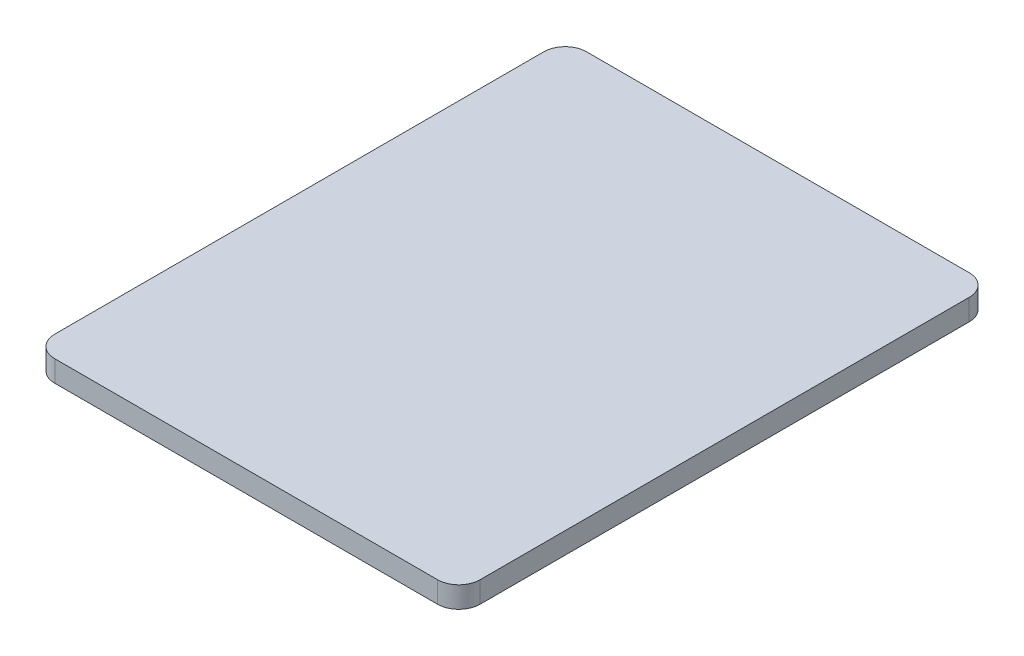
ISO-10303-21;
HEADER;
FILE_DESCRIPTION(('STEP AP214'),'2;1');
FILE_NAME('part.step','',(''),(''),'','','');
FILE_SCHEMA(('AUTOMOTIVE_DESIGN { 1 0 10303 214 1 1 1 1 }'));
ENDSEC;
DATA;
#1=APPLICATION_CONTEXT('core data for automotive mechanical design processes');
#2=APPLICATION_PROTOCOL_DEFINITION('international standard','automotive_design',2000,#1);
#3=PRODUCT_CONTEXT('',#1,'mechanical');
#4=PRODUCT('Part','Part','',(#3));
#5=PRODUCT_RELATED_PRODUCT_CATEGORY('part','',(#4));
#6=PRODUCT_DEFINITION_FORMATION('','',#4);
#7=PRODUCT_DEFINITION_CONTEXT('part definition',#1,'design');
#8=PRODUCT_DEFINITION('design','',#6,#7);
#9=PRODUCT_DEFINITION_SHAPE('','',#8);
#10=(LENGTH_UNIT() NAMED_UNIT(*) SI_UNIT(.MILLI.,.METRE.));
#11=(NAMED_UNIT(*) PLANE_ANGLE_UNIT() SI_UNIT($,.RADIAN.));
#12=(NAMED_UNIT(*) SI_UNIT($,.STERADIAN.) SOLID_ANGLE_UNIT());
#13=UNCERTAINTY_MEASURE_WITH_UNIT(LENGTH_MEASURE(1.E-05),#10,'distance_accuracy_value','');
#14=(GEOMETRIC_REPRESENTATION_CONTEXT(3) GLOBAL_UNCERTAINTY_ASSIGNED_CONTEXT((#13)) GLOBAL_UNIT_ASSIGNED_CONTEXT((#10,
#11,#12)) REPRESENTATION_CONTEXT('',''));
#15=CARTESIAN_POINT('',(0.,0.,0.));
#16=DIRECTION('',(0.,0.,1.));
#17=DIRECTION('',(1.,0.,0.));
#18=AXIS2_PLACEMENT_3D('',#15,#16,#17);
#19=CARTESIAN_POINT('',(100.,10.,125.));
#20=DIRECTION('',(-1.,0.,0.));
#21=DIRECTION('',(0.,0.,1.));
#22=AXIS2_PLACEMENT_3D('',#19,#20,#21);
#23=PLANE('',#22);
#24=DIRECTION('',(0.,0.,-1.));
#25=VECTOR('',#24,1.);
#26=CARTESIAN_POINT('',(100.,0.,125.));
#27=LINE('',#26,#25);
#28=CARTESIAN_POINT('',(100.,0.,115.));
#29=VERTEX_POINT('',#28);
#30=CARTESIAN_POINT('',(100.,0.,-115.));
#31=VERTEX_POINT('',#30);
#32=EDGE_CURVE('E137',#29,#31,#27,.T.);
#33=ORIENTED_EDGE('',*,*,#32,.T.);
#34=DIRECTION('',(0.,-1.,0.));
#35=VECTOR('',#34,1.);
#36=CARTESIAN_POINT('',(100.,10.,-115.));
#37=LINE('',#36,#35);
#38=CARTESIAN_POINT('',(100.,10.,-115.));
#39=VERTEX_POINT('',#38);
#40=EDGE_CURVE('E117',#31,#39,#37,.F.);
#41=ORIENTED_EDGE('',*,*,#40,.T.);
#42=DIRECTION('',(0.,0.,-1.));
#43=VECTOR('',#42,1.);
#44=CARTESIAN_POINT('',(100.,10.,125.));
#45=LINE('',#44,#43);
#46=CARTESIAN_POINT('',(100.,10.,115.));
#47=VERTEX_POINT('',#46);
#48=EDGE_CURVE('E148',#47,#39,#45,.T.);
#49=ORIENTED_EDGE('',*,*,#48,.F.);
#50=DIRECTION('',(0.,-1.,0.));
#51=VECTOR('',#50,1.);
#52=CARTESIAN_POINT('',(100.,10.,115.));
#53=LINE('',#52,#51);
#54=EDGE_CURVE('E123',#47,#29,#53,.T.);
#55=ORIENTED_EDGE('',*,*,#54,.T.);
#56=EDGE_LOOP('',(#33,#41,#49,#55));
#57=FACE_BOUND('',#56,.T.);
#58=ADVANCED_FACE('F43',(#57),#23,.F.);
#59=CARTESIAN_POINT('',(-100.,10.,-125.));
#60=DIRECTION('',(0.,0.,1.));
#61=DIRECTION('',(1.,0.,0.));
#62=AXIS2_PLACEMENT_3D('',#59,#60,#61);
#63=PLANE('',#62);
#64=DIRECTION('',(-1.,0.,0.));
#65=VECTOR('',#64,1.);
#66=CARTESIAN_POINT('',(-100.,0.,-125.));
#67=LINE('',#66,#65);
#68=CARTESIAN_POINT('',(90.,0.,-125.));
#69=VERTEX_POINT('',#68);
#70=CARTESIAN_POINT('',(-90.,0.,-125.));
#71=VERTEX_POINT('',#70);
#72=EDGE_CURVE('E127',#69,#71,#67,.T.);
#73=ORIENTED_EDGE('',*,*,#72,.T.);
#74=DIRECTION('',(0.,-1.,0.));
#75=VECTOR('',#74,1.);
#76=CARTESIAN_POINT('',(-90.,10.,-125.));
#77=LINE('',#76,#75);
#78=CARTESIAN_POINT('',(-90.,10.,-125.));
#79=VERTEX_POINT('',#78);
#80=EDGE_CURVE('E67',#71,#79,#77,.F.);
#81=ORIENTED_EDGE('',*,*,#80,.T.);
#82=DIRECTION('',(-1.,0.,0.));
#83=VECTOR('',#82,1.);
#84=CARTESIAN_POINT('',(-100.,10.,-125.));
#85=LINE('',#84,#83);
#86=CARTESIAN_POINT('',(90.,10.,-125.));
#87=VERTEX_POINT('',#86);
#88=EDGE_CURVE('E128',#87,#79,#85,.T.);
#89=ORIENTED_EDGE('',*,*,#88,.F.);
#90=DIRECTION('',(0.,-1.,0.));
#91=VECTOR('',#90,1.);
#92=CARTESIAN_POINT('',(90.,10.,-125.));
#93=LINE('',#92,#91);
#94=EDGE_CURVE('E116',#87,#69,#93,.T.);
#95=ORIENTED_EDGE('',*,*,#94,.T.);
#96=EDGE_LOOP('',(#73,#81,#89,#95));
#97=FACE_BOUND('',#96,.T.);
#98=ADVANCED_FACE('F126',(#97),#63,.F.);
#99=CARTESIAN_POINT('',(-100.,10.,125.));
#100=DIRECTION('',(1.,0.,0.));
#101=DIRECTION('',(0.,0.,-1.));
#102=AXIS2_PLACEMENT_3D('',#99,#100,#101);
#103=PLANE('',#102);
#104=DIRECTION('',(0.,0.,1.));
#105=VECTOR('',#104,1.);
#106=CARTESIAN_POINT('',(-100.,10.,125.));
#107=LINE('',#106,#105);
#108=CARTESIAN_POINT('',(-100.,10.,-115.));
#109=VERTEX_POINT('',#108);
#110=CARTESIAN_POINT('',(-100.,10.,115.));
#111=VERTEX_POINT('',#110);
#112=EDGE_CURVE('E187',#109,#111,#107,.T.);
#113=ORIENTED_EDGE('',*,*,#112,.F.);
#114=DIRECTION('',(0.,-1.,0.));
#115=VECTOR('',#114,1.);
#116=CARTESIAN_POINT('',(-100.,10.,-115.));
#117=LINE('',#116,#115);
#118=CARTESIAN_POINT('',(-100.,0.,-115.));
#119=VERTEX_POINT('',#118);
#120=EDGE_CURVE('E171',#109,#119,#117,.T.);
#121=ORIENTED_EDGE('',*,*,#120,.T.);
#122=DIRECTION('',(0.,0.,1.));
#123=VECTOR('',#122,1.);
#124=CARTESIAN_POINT('',(-100.,0.,125.));
#125=LINE('',#124,#123);
#126=CARTESIAN_POINT('',(-100.,0.,115.));
#127=VERTEX_POINT('',#126);
#128=EDGE_CURVE('E136',#119,#127,#125,.T.);
#129=ORIENTED_EDGE('',*,*,#128,.T.);
#130=DIRECTION('',(0.,-1.,0.));
#131=VECTOR('',#130,1.);
#132=CARTESIAN_POINT('',(-100.,10.,115.));
#133=LINE('',#132,#131);
#134=EDGE_CURVE('E168',#127,#111,#133,.F.);
#135=ORIENTED_EDGE('',*,*,#134,.T.);
#136=EDGE_LOOP('',(#113,#121,#129,#135));
#137=FACE_BOUND('',#136,.T.);
#138=ADVANCED_FACE('F191',(#137),#103,.F.);
#139=CARTESIAN_POINT('',(-100.,10.,125.));
#140=DIRECTION('',(0.,0.,-1.));
#141=DIRECTION('',(-1.,0.,0.));
#142=AXIS2_PLACEMENT_3D('',#139,#140,#141);
#143=PLANE('',#142);
#144=DIRECTION('',(1.,0.,0.));
#145=VECTOR('',#144,1.);
#146=CARTESIAN_POINT('',(-100.,10.,125.));
#147=LINE('',#146,#145);
#148=CARTESIAN_POINT('',(-90.,10.,125.));
#149=VERTEX_POINT('',#148);
#150=CARTESIAN_POINT('',(90.,10.,125.));
#151=VERTEX_POINT('',#150);
#152=EDGE_CURVE('E130',#149,#151,#147,.T.);
#153=ORIENTED_EDGE('',*,*,#152,.F.);
#154=DIRECTION('',(0.,-1.,0.));
#155=VECTOR('',#154,1.);
#156=CARTESIAN_POINT('',(-90.,10.,125.));
#157=LINE('',#156,#155);
#158=CARTESIAN_POINT('',(-90.,0.,125.));
#159=VERTEX_POINT('',#158);
#160=EDGE_CURVE('E11',#149,#159,#157,.T.);
#161=ORIENTED_EDGE('',*,*,#160,.T.);
#162=DIRECTION('',(1.,0.,0.));
#163=VECTOR('',#162,1.);
#164=CARTESIAN_POINT('',(-100.,0.,125.));
#165=LINE('',#164,#163);
#166=CARTESIAN_POINT('',(90.,0.,125.));
#167=VERTEX_POINT('',#166);
#168=EDGE_CURVE('E142',#159,#167,#165,.T.);
#169=ORIENTED_EDGE('',*,*,#168,.T.);
#170=DIRECTION('',(0.,-1.,0.));
#171=VECTOR('',#170,1.);
#172=CARTESIAN_POINT('',(90.,10.,125.));
#173=LINE('',#172,#171);
#174=EDGE_CURVE('E164',#167,#151,#173,.F.);
#175=ORIENTED_EDGE('',*,*,#174,.T.);
#176=EDGE_LOOP('',(#153,#161,#169,#175));
#177=FACE_BOUND('',#176,.T.);
#178=ADVANCED_FACE('F222',(#177),#143,.F.);
#179=CARTESIAN_POINT('',(0.,10.,0.));
#180=DIRECTION('',(0.,-1.,0.));
#181=DIRECTION('',(0.,0.,-1.));
#182=AXIS2_PLACEMENT_3D('',#179,#180,#181);
#183=PLANE('',#182);
#184=ORIENTED_EDGE('',*,*,#88,.T.);
#185=CARTESIAN_POINT('',(-90.,10.,-115.));
#186=DIRECTION('',(0.,-1.,0.));
#187=DIRECTION('',(0.,0.,-1.));
#188=AXIS2_PLACEMENT_3D('',#185,#186,#187);
#189=CIRCLE('',#188,10.);
#190=EDGE_CURVE('E52',#79,#109,#189,.F.);
#191=ORIENTED_EDGE('',*,*,#190,.T.);
#192=ORIENTED_EDGE('',*,*,#112,.T.);
#193=CARTESIAN_POINT('',(-90.,10.,115.));
#194=DIRECTION('',(0.,-1.,0.));
#195=DIRECTION('',(0.,0.,-1.));
#196=AXIS2_PLACEMENT_3D('',#193,#194,#195);
#197=CIRCLE('',#196,10.);
#198=EDGE_CURVE('E59',#111,#149,#197,.F.);
#199=ORIENTED_EDGE('',*,*,#198,.T.);
#200=ORIENTED_EDGE('',*,*,#152,.T.);
#201=CARTESIAN_POINT('',(90.,10.,115.));
#202=DIRECTION('',(0.,-1.,0.));
#203=DIRECTION('',(0.,0.,-1.));
#204=AXIS2_PLACEMENT_3D('',#201,#202,#203);
#205=CIRCLE('',#204,10.);
#206=EDGE_CURVE('E158',#151,#47,#205,.F.);
#207=ORIENTED_EDGE('',*,*,#206,.T.);
#208=ORIENTED_EDGE('',*,*,#48,.T.);
#209=CARTESIAN_POINT('',(90.,10.,-115.));
#210=DIRECTION('',(0.,-1.,0.));
#211=DIRECTION('',(0.,0.,-1.));
#212=AXIS2_PLACEMENT_3D('',#209,#210,#211);
#213=CIRCLE('',#212,10.);
#214=EDGE_CURVE('E161',#39,#87,#213,.F.);
#215=ORIENTED_EDGE('',*,*,#214,.T.);
#216=EDGE_LOOP('',(#184,#191,#192,#199,#200,#207,#208,#215));
#217=FACE_BOUND('',#216,.T.);
#218=ADVANCED_FACE('F186',(#217),#183,.F.);
#219=CARTESIAN_POINT('',(0.,0.,0.));
#220=DIRECTION('',(0.,-1.,0.));
#221=DIRECTION('',(0.,0.,-1.));
#222=AXIS2_PLACEMENT_3D('',#219,#220,#221);
#223=PLANE('',#222);
#224=ORIENTED_EDGE('',*,*,#128,.F.);
#225=CARTESIAN_POINT('',(-90.,0.,-115.));
#226=DIRECTION('',(0.,-1.,0.));
#227=DIRECTION('',(0.,0.,-1.));
#228=AXIS2_PLACEMENT_3D('',#225,#226,#227);
#229=CIRCLE('',#228,10.);
#230=EDGE_CURVE('E134',#119,#71,#229,.T.);
#231=ORIENTED_EDGE('',*,*,#230,.T.);
#232=ORIENTED_EDGE('',*,*,#72,.F.);
#233=CARTESIAN_POINT('',(90.,0.,-115.));
#234=DIRECTION('',(0.,-1.,0.));
#235=DIRECTION('',(0.,0.,-1.));
#236=AXIS2_PLACEMENT_3D('',#233,#234,#235);
#237=CIRCLE('',#236,10.);
#238=EDGE_CURVE('E112',#69,#31,#237,.T.);
#239=ORIENTED_EDGE('',*,*,#238,.T.);
#240=ORIENTED_EDGE('',*,*,#32,.F.);
#241=CARTESIAN_POINT('',(90.,0.,115.));
#242=DIRECTION('',(0.,-1.,0.));
#243=DIRECTION('',(0.,0.,-1.));
#244=AXIS2_PLACEMENT_3D('',#241,#242,#243);
#245=CIRCLE('',#244,10.);
#246=EDGE_CURVE('E124',#29,#167,#245,.T.);
#247=ORIENTED_EDGE('',*,*,#246,.T.);
#248=ORIENTED_EDGE('',*,*,#168,.F.);
#249=CARTESIAN_POINT('',(-90.,0.,115.));
#250=DIRECTION('',(0.,-1.,0.));
#251=DIRECTION('',(0.,0.,-1.));
#252=AXIS2_PLACEMENT_3D('',#249,#250,#251);
#253=CIRCLE('',#252,10.);
#254=EDGE_CURVE('E175',#159,#127,#253,.T.);
#255=ORIENTED_EDGE('',*,*,#254,.T.);
#256=EDGE_LOOP('',(#224,#231,#232,#239,#240,#247,#248,#255));
#257=FACE_BOUND('',#256,.T.);
#258=ADVANCED_FACE('F133',(#257),#223,.T.);
#259=CARTESIAN_POINT('',(90.,10.,-115.));
#260=DIRECTION('',(0.,-1.,0.));
#261=DIRECTION('',(0.,0.,-1.));
#262=AXIS2_PLACEMENT_3D('',#259,#260,#261);
#263=CYLINDRICAL_SURFACE('',#262,10.);
#264=ORIENTED_EDGE('',*,*,#214,.F.);
#265=ORIENTED_EDGE('',*,*,#40,.F.);
#266=ORIENTED_EDGE('',*,*,#238,.F.);
#267=ORIENTED_EDGE('',*,*,#94,.F.);
#268=EDGE_LOOP('',(#264,#265,#266,#267));
#269=FACE_BOUND('',#268,.T.);
#270=ADVANCED_FACE('F115',(#269),#263,.T.);
#271=CARTESIAN_POINT('',(90.,10.,115.));
#272=DIRECTION('',(0.,-1.,0.));
#273=DIRECTION('',(0.,0.,-1.));
#274=AXIS2_PLACEMENT_3D('',#271,#272,#273);
#275=CYLINDRICAL_SURFACE('',#274,10.);
#276=ORIENTED_EDGE('',*,*,#206,.F.);
#277=ORIENTED_EDGE('',*,*,#174,.F.);
#278=ORIENTED_EDGE('',*,*,#246,.F.);
#279=ORIENTED_EDGE('',*,*,#54,.F.);
#280=EDGE_LOOP('',(#276,#277,#278,#279));
#281=FACE_BOUND('',#280,.T.);
#282=ADVANCED_FACE('F197',(#281),#275,.T.);
#283=CARTESIAN_POINT('',(-90.,10.,-115.));
#284=DIRECTION('',(0.,-1.,0.));
#285=DIRECTION('',(0.,0.,-1.));
#286=AXIS2_PLACEMENT_3D('',#283,#284,#285);
#287=CYLINDRICAL_SURFACE('',#286,10.);
#288=ORIENTED_EDGE('',*,*,#190,.F.);
#289=ORIENTED_EDGE('',*,*,#80,.F.);
#290=ORIENTED_EDGE('',*,*,#230,.F.);
#291=ORIENTED_EDGE('',*,*,#120,.F.);
#292=EDGE_LOOP('',(#288,#289,#290,#291));
#293=FACE_BOUND('',#292,.T.);
#294=ADVANCED_FACE('F195',(#293),#287,.T.);
#295=CARTESIAN_POINT('',(-90.,10.,115.));
#296=DIRECTION('',(0.,-1.,0.));
#297=DIRECTION('',(0.,0.,-1.));
#298=AXIS2_PLACEMENT_3D('',#295,#296,#297);
#299=CYLINDRICAL_SURFACE('',#298,10.);
#300=ORIENTED_EDGE('',*,*,#198,.F.);
#301=ORIENTED_EDGE('',*,*,#134,.F.);
#302=ORIENTED_EDGE('',*,*,#254,.F.);
#303=ORIENTED_EDGE('',*,*,#160,.F.);
#304=EDGE_LOOP('',(#300,#301,#302,#303));
#305=FACE_BOUND('',#304,.T.);
#306=ADVANCED_FACE('F45',(#305),#299,.T.);
#307=CLOSED_SHELL('',(#58,#98,#138,#178,#218,#258,#270,#282,#294,#306));
#308=MANIFOLD_SOLID_BREP('B2',#307);
#309=ADVANCED_BREP_SHAPE_REPRESENTATION('',(#18,#308),#14);
#310=SHAPE_DEFINITION_REPRESENTATION(#9,#309);
ENDSEC;
END-ISO-10303-21;
